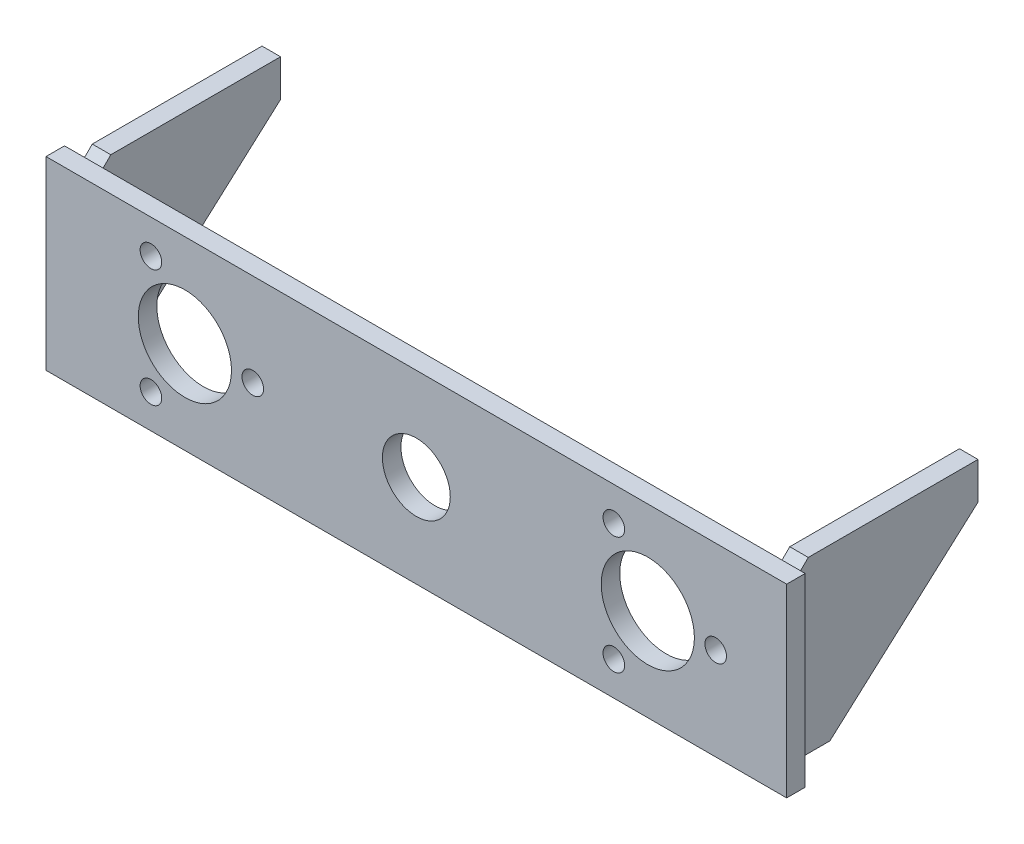
ISO-10303-21;
HEADER;
FILE_DESCRIPTION(('STEP AP214'),'2;1');
FILE_NAME('part.step','',(''),(''),'','','');
FILE_SCHEMA(('AUTOMOTIVE_DESIGN { 1 0 10303 214 1 1 1 1 }'));
ENDSEC;
DATA;
#1=APPLICATION_CONTEXT('core data for automotive mechanical design processes');
#2=APPLICATION_PROTOCOL_DEFINITION('international standard','automotive_design',2000,#1);
#3=PRODUCT_CONTEXT('',#1,'mechanical');
#4=PRODUCT('Part','Part','',(#3));
#5=PRODUCT_RELATED_PRODUCT_CATEGORY('part','',(#4));
#6=PRODUCT_DEFINITION_FORMATION('','',#4);
#7=PRODUCT_DEFINITION_CONTEXT('part definition',#1,'design');
#8=PRODUCT_DEFINITION('design','',#6,#7);
#9=PRODUCT_DEFINITION_SHAPE('','',#8);
#10=(LENGTH_UNIT() NAMED_UNIT(*) SI_UNIT(.MILLI.,.METRE.));
#11=(NAMED_UNIT(*) PLANE_ANGLE_UNIT() SI_UNIT($,.RADIAN.));
#12=(NAMED_UNIT(*) SI_UNIT($,.STERADIAN.) SOLID_ANGLE_UNIT());
#13=UNCERTAINTY_MEASURE_WITH_UNIT(LENGTH_MEASURE(1.E-05),#10,'distance_accuracy_value','');
#14=(GEOMETRIC_REPRESENTATION_CONTEXT(3) GLOBAL_UNCERTAINTY_ASSIGNED_CONTEXT((#13)) GLOBAL_UNIT_ASSIGNED_CONTEXT((#10,
#11,#12)) REPRESENTATION_CONTEXT('',''));
#15=CARTESIAN_POINT('',(0.,0.,0.));
#16=DIRECTION('',(0.,0.,1.));
#17=DIRECTION('',(1.,0.,0.));
#18=AXIS2_PLACEMENT_3D('',#15,#16,#17);
#19=CARTESIAN_POINT('',(-116.,30.,-11.));
#20=DIRECTION('',(0.,0.707106781186548,0.707106781186547));
#21=DIRECTION('',(0.,-0.707106781186547,0.707106781186548));
#22=AXIS2_PLACEMENT_3D('',#19,#20,#21);
#23=PLANE('',#22);
#24=DIRECTION('',(0.,-0.707106781186547,0.707106781186548));
#25=VECTOR('',#24,1.);
#26=CARTESIAN_POINT('',(-110.,30.,-11.));
#27=LINE('',#26,#25);
#28=CARTESIAN_POINT('',(-110.,30.,-11.));
#29=VERTEX_POINT('',#28);
#30=CARTESIAN_POINT('',(-110.,25.,-6.));
#31=VERTEX_POINT('',#30);
#32=EDGE_CURVE('E133',#29,#31,#27,.T.);
#33=ORIENTED_EDGE('',*,*,#32,.F.);
#34=DIRECTION('',(1.,0.,0.));
#35=VECTOR('',#34,1.);
#36=CARTESIAN_POINT('',(-116.,30.,-11.));
#37=LINE('',#36,#35);
#38=CARTESIAN_POINT('',(-116.,30.,-11.));
#39=VERTEX_POINT('',#38);
#40=EDGE_CURVE('E12',#39,#29,#37,.T.);
#41=ORIENTED_EDGE('',*,*,#40,.F.);
#42=DIRECTION('',(0.,-0.707106781186547,0.707106781186548));
#43=VECTOR('',#42,1.);
#44=CARTESIAN_POINT('',(-116.,30.,-11.));
#45=LINE('',#44,#43);
#46=CARTESIAN_POINT('',(-116.,25.,-6.));
#47=VERTEX_POINT('',#46);
#48=EDGE_CURVE('E147',#39,#47,#45,.T.);
#49=ORIENTED_EDGE('',*,*,#48,.T.);
#50=DIRECTION('',(1.,0.,0.));
#51=VECTOR('',#50,1.);
#52=CARTESIAN_POINT('',(-116.,25.,-6.));
#53=LINE('',#52,#51);
#54=EDGE_CURVE('E51',#47,#31,#53,.T.);
#55=ORIENTED_EDGE('',*,*,#54,.T.);
#56=EDGE_LOOP('',(#33,#41,#49,#55));
#57=FACE_BOUND('',#56,.T.);
#58=ADVANCED_FACE('F48',(#57),#23,.T.);
#59=CARTESIAN_POINT('',(-116.,30.,-66.));
#60=DIRECTION('',(0.,1.,0.));
#61=DIRECTION('',(0.,0.,1.));
#62=AXIS2_PLACEMENT_3D('',#59,#60,#61);
#63=PLANE('',#62);
#64=DIRECTION('',(0.,0.,1.));
#65=VECTOR('',#64,1.);
#66=CARTESIAN_POINT('',(-110.,30.,-66.));
#67=LINE('',#66,#65);
#68=CARTESIAN_POINT('',(-110.,30.,-66.));
#69=VERTEX_POINT('',#68);
#70=EDGE_CURVE('E145',#69,#29,#67,.T.);
#71=ORIENTED_EDGE('',*,*,#70,.F.);
#72=DIRECTION('',(1.,0.,0.));
#73=VECTOR('',#72,1.);
#74=CARTESIAN_POINT('',(-116.,30.,-66.));
#75=LINE('',#74,#73);
#76=CARTESIAN_POINT('',(-116.,30.,-66.));
#77=VERTEX_POINT('',#76);
#78=EDGE_CURVE('E57',#77,#69,#75,.T.);
#79=ORIENTED_EDGE('',*,*,#78,.F.);
#80=DIRECTION('',(0.,0.,1.));
#81=VECTOR('',#80,1.);
#82=CARTESIAN_POINT('',(-116.,30.,-66.));
#83=LINE('',#82,#81);
#84=EDGE_CURVE('E123',#77,#39,#83,.T.);
#85=ORIENTED_EDGE('',*,*,#84,.T.);
#86=ORIENTED_EDGE('',*,*,#40,.T.);
#87=EDGE_LOOP('',(#71,#79,#85,#86));
#88=FACE_BOUND('',#87,.T.);
#89=ADVANCED_FACE('F155',(#88),#63,.T.);
#90=CARTESIAN_POINT('',(-116.,18.,-66.));
#91=DIRECTION('',(0.,0.,-1.));
#92=DIRECTION('',(0.,1.,0.));
#93=AXIS2_PLACEMENT_3D('',#90,#91,#92);
#94=PLANE('',#93);
#95=DIRECTION('',(0.,1.,0.));
#96=VECTOR('',#95,1.);
#97=CARTESIAN_POINT('',(-110.,18.,-66.));
#98=LINE('',#97,#96);
#99=CARTESIAN_POINT('',(-110.,18.,-66.));
#100=VERTEX_POINT('',#99);
#101=EDGE_CURVE('E110',#100,#69,#98,.T.);
#102=ORIENTED_EDGE('',*,*,#101,.F.);
#103=DIRECTION('',(1.,0.,0.));
#104=VECTOR('',#103,1.);
#105=CARTESIAN_POINT('',(-116.,18.,-66.));
#106=LINE('',#105,#104);
#107=CARTESIAN_POINT('',(-116.,18.,-66.));
#108=VERTEX_POINT('',#107);
#109=EDGE_CURVE('E105',#108,#100,#106,.T.);
#110=ORIENTED_EDGE('',*,*,#109,.F.);
#111=DIRECTION('',(0.,1.,0.));
#112=VECTOR('',#111,1.);
#113=CARTESIAN_POINT('',(-116.,18.,-66.));
#114=LINE('',#113,#112);
#115=EDGE_CURVE('E108',#108,#77,#114,.T.);
#116=ORIENTED_EDGE('',*,*,#115,.T.);
#117=ORIENTED_EDGE('',*,*,#78,.T.);
#118=EDGE_LOOP('',(#102,#110,#116,#117));
#119=FACE_BOUND('',#118,.T.);
#120=ADVANCED_FACE('F107',(#119),#94,.T.);
#121=CARTESIAN_POINT('',(-116.,-25.,-18.));
#122=DIRECTION('',(0.,-0.744835335723058,-0.66724832158524));
#123=DIRECTION('',(0.,0.66724832158524,-0.744835335723058));
#124=AXIS2_PLACEMENT_3D('',#121,#122,#123);
#125=PLANE('',#124);
#126=DIRECTION('',(0.,0.66724832158524,-0.744835335723058));
#127=VECTOR('',#126,1.);
#128=CARTESIAN_POINT('',(-110.,-25.,-18.));
#129=LINE('',#128,#127);
#130=CARTESIAN_POINT('',(-110.,-25.,-18.));
#131=VERTEX_POINT('',#130);
#132=EDGE_CURVE('E142',#131,#100,#129,.T.);
#133=ORIENTED_EDGE('',*,*,#132,.F.);
#134=DIRECTION('',(1.,0.,0.));
#135=VECTOR('',#134,1.);
#136=CARTESIAN_POINT('',(-116.,-25.,-18.));
#137=LINE('',#136,#135);
#138=CARTESIAN_POINT('',(-116.,-25.,-18.));
#139=VERTEX_POINT('',#138);
#140=EDGE_CURVE('E115',#139,#131,#137,.T.);
#141=ORIENTED_EDGE('',*,*,#140,.F.);
#142=DIRECTION('',(0.,0.66724832158524,-0.744835335723058));
#143=VECTOR('',#142,1.);
#144=CARTESIAN_POINT('',(-116.,-25.,-18.));
#145=LINE('',#144,#143);
#146=EDGE_CURVE('E121',#139,#108,#145,.T.);
#147=ORIENTED_EDGE('',*,*,#146,.T.);
#148=ORIENTED_EDGE('',*,*,#109,.T.);
#149=EDGE_LOOP('',(#133,#141,#147,#148));
#150=FACE_BOUND('',#149,.T.);
#151=ADVANCED_FACE('F125',(#150),#125,.T.);
#152=CARTESIAN_POINT('',(-116.,-25.,-6.));
#153=DIRECTION('',(0.,-1.,0.));
#154=DIRECTION('',(0.,0.,-1.));
#155=AXIS2_PLACEMENT_3D('',#152,#153,#154);
#156=PLANE('',#155);
#157=DIRECTION('',(0.,0.,-1.));
#158=VECTOR('',#157,1.);
#159=CARTESIAN_POINT('',(-110.,-25.,-6.));
#160=LINE('',#159,#158);
#161=CARTESIAN_POINT('',(-110.,-25.,-6.));
#162=VERTEX_POINT('',#161);
#163=EDGE_CURVE('E139',#162,#131,#160,.T.);
#164=ORIENTED_EDGE('',*,*,#163,.F.);
#165=DIRECTION('',(1.,0.,0.));
#166=VECTOR('',#165,1.);
#167=CARTESIAN_POINT('',(-116.,-25.,-6.));
#168=LINE('',#167,#166);
#169=CARTESIAN_POINT('',(-116.,-25.,-6.));
#170=VERTEX_POINT('',#169);
#171=EDGE_CURVE('E150',#170,#162,#168,.T.);
#172=ORIENTED_EDGE('',*,*,#171,.F.);
#173=DIRECTION('',(0.,0.,-1.));
#174=VECTOR('',#173,1.);
#175=CARTESIAN_POINT('',(-116.,-25.,-6.));
#176=LINE('',#175,#174);
#177=EDGE_CURVE('E126',#170,#139,#176,.T.);
#178=ORIENTED_EDGE('',*,*,#177,.T.);
#179=ORIENTED_EDGE('',*,*,#140,.T.);
#180=EDGE_LOOP('',(#164,#172,#178,#179));
#181=FACE_BOUND('',#180,.T.);
#182=ADVANCED_FACE('F168',(#181),#156,.T.);
#183=CARTESIAN_POINT('',(-116.,25.,-6.));
#184=DIRECTION('',(0.,0.,1.));
#185=DIRECTION('',(1.,0.,0.));
#186=AXIS2_PLACEMENT_3D('',#183,#184,#185);
#187=PLANE('',#186);
#188=DIRECTION('',(0.,-1.,0.));
#189=VECTOR('',#188,1.);
#190=CARTESIAN_POINT('',(-110.,25.,-6.));
#191=LINE('',#190,#189);
#192=EDGE_CURVE('E136',#31,#162,#191,.T.);
#193=ORIENTED_EDGE('',*,*,#192,.F.);
#194=ORIENTED_EDGE('',*,*,#54,.F.);
#195=DIRECTION('',(0.,-1.,0.));
#196=VECTOR('',#195,1.);
#197=CARTESIAN_POINT('',(-116.,25.,-6.));
#198=LINE('',#197,#196);
#199=EDGE_CURVE('E128',#47,#170,#198,.T.);
#200=ORIENTED_EDGE('',*,*,#199,.T.);
#201=ORIENTED_EDGE('',*,*,#171,.T.);
#202=EDGE_LOOP('',(#193,#194,#200,#201));
#203=FACE_BOUND('',#202,.T.);
#204=ADVANCED_FACE('F152',(#203),#187,.T.);
#205=CARTESIAN_POINT('',(-116.,0.,0.));
#206=DIRECTION('',(1.,0.,0.));
#207=DIRECTION('',(0.,0.,-1.));
#208=AXIS2_PLACEMENT_3D('',#205,#206,#207);
#209=PLANE('',#208);
#210=ORIENTED_EDGE('',*,*,#48,.F.);
#211=ORIENTED_EDGE('',*,*,#84,.F.);
#212=ORIENTED_EDGE('',*,*,#115,.F.);
#213=ORIENTED_EDGE('',*,*,#146,.F.);
#214=ORIENTED_EDGE('',*,*,#177,.F.);
#215=ORIENTED_EDGE('',*,*,#199,.F.);
#216=EDGE_LOOP('',(#210,#211,#212,#213,#214,#215));
#217=FACE_BOUND('',#216,.T.);
#218=ADVANCED_FACE('F119',(#217),#209,.F.);
#219=CARTESIAN_POINT('',(-110.,0.,0.));
#220=DIRECTION('',(1.,0.,0.));
#221=DIRECTION('',(0.,0.,-1.));
#222=AXIS2_PLACEMENT_3D('',#219,#220,#221);
#223=PLANE('',#222);
#224=ORIENTED_EDGE('',*,*,#32,.T.);
#225=ORIENTED_EDGE('',*,*,#192,.T.);
#226=ORIENTED_EDGE('',*,*,#163,.T.);
#227=ORIENTED_EDGE('',*,*,#132,.T.);
#228=ORIENTED_EDGE('',*,*,#101,.T.);
#229=ORIENTED_EDGE('',*,*,#70,.T.);
#230=EDGE_LOOP('',(#224,#225,#226,#227,#228,#229));
#231=FACE_BOUND('',#230,.T.);
#232=ADVANCED_FACE('F154',(#231),#223,.T.);
#233=CLOSED_SHELL('',(#58,#89,#120,#151,#182,#204,#218,#232));
#234=MANIFOLD_SOLID_BREP('B2',#233);
#235=CARTESIAN_POINT('',(116.,25.,-6.));
#236=DIRECTION('',(0.,-0.707106781186548,-0.707106781186547));
#237=DIRECTION('',(0.,0.707106781186547,-0.707106781186548));
#238=AXIS2_PLACEMENT_3D('',#235,#236,#237);
#239=PLANE('',#238);
#240=DIRECTION('',(0.,-0.707106781186547,0.707106781186548));
#241=VECTOR('',#240,1.);
#242=CARTESIAN_POINT('',(110.,25.,-6.));
#243=LINE('',#242,#241);
#244=CARTESIAN_POINT('',(110.,30.,-11.));
#245=VERTEX_POINT('',#244);
#246=CARTESIAN_POINT('',(110.,25.,-6.));
#247=VERTEX_POINT('',#246);
#248=EDGE_CURVE('E333',#245,#247,#243,.T.);
#249=ORIENTED_EDGE('',*,*,#248,.T.);
#250=DIRECTION('',(-1.,0.,0.));
#251=VECTOR('',#250,1.);
#252=CARTESIAN_POINT('',(116.,25.,-6.));
#253=LINE('',#252,#251);
#254=CARTESIAN_POINT('',(116.,25.,-6.));
#255=VERTEX_POINT('',#254);
#256=EDGE_CURVE('E46',#255,#247,#253,.T.);
#257=ORIENTED_EDGE('',*,*,#256,.F.);
#258=DIRECTION('',(0.,-0.707106781186547,0.707106781186548));
#259=VECTOR('',#258,1.);
#260=CARTESIAN_POINT('',(116.,25.,-6.));
#261=LINE('',#260,#259);
#262=CARTESIAN_POINT('',(116.,30.,-11.));
#263=VERTEX_POINT('',#262);
#264=EDGE_CURVE('E343',#263,#255,#261,.T.);
#265=ORIENTED_EDGE('',*,*,#264,.F.);
#266=DIRECTION('',(-1.,0.,0.));
#267=VECTOR('',#266,1.);
#268=CARTESIAN_POINT('',(116.,30.,-11.));
#269=LINE('',#268,#267);
#270=EDGE_CURVE('E329',#263,#245,#269,.T.);
#271=ORIENTED_EDGE('',*,*,#270,.T.);
#272=EDGE_LOOP('',(#249,#257,#265,#271));
#273=FACE_BOUND('',#272,.T.);
#274=ADVANCED_FACE('F249',(#273),#239,.F.);
#275=CARTESIAN_POINT('',(116.,-25.,-6.));
#276=DIRECTION('',(0.,0.,-1.));
#277=DIRECTION('',(-1.,0.,0.));
#278=AXIS2_PLACEMENT_3D('',#275,#276,#277);
#279=PLANE('',#278);
#280=DIRECTION('',(0.,-1.,0.));
#281=VECTOR('',#280,1.);
#282=CARTESIAN_POINT('',(110.,-25.,-6.));
#283=LINE('',#282,#281);
#284=CARTESIAN_POINT('',(110.,-25.,-6.));
#285=VERTEX_POINT('',#284);
#286=EDGE_CURVE('E336',#247,#285,#283,.T.);
#287=ORIENTED_EDGE('',*,*,#286,.T.);
#288=DIRECTION('',(-1.,0.,0.));
#289=VECTOR('',#288,1.);
#290=CARTESIAN_POINT('',(116.,-25.,-6.));
#291=LINE('',#290,#289);
#292=CARTESIAN_POINT('',(116.,-25.,-6.));
#293=VERTEX_POINT('',#292);
#294=EDGE_CURVE('E257',#293,#285,#291,.T.);
#295=ORIENTED_EDGE('',*,*,#294,.F.);
#296=DIRECTION('',(0.,-1.,0.));
#297=VECTOR('',#296,1.);
#298=CARTESIAN_POINT('',(116.,-25.,-6.));
#299=LINE('',#298,#297);
#300=EDGE_CURVE('E302',#255,#293,#299,.T.);
#301=ORIENTED_EDGE('',*,*,#300,.F.);
#302=ORIENTED_EDGE('',*,*,#256,.T.);
#303=EDGE_LOOP('',(#287,#295,#301,#302));
#304=FACE_BOUND('',#303,.T.);
#305=ADVANCED_FACE('F367',(#304),#279,.F.);
#306=CARTESIAN_POINT('',(116.,-25.,-18.));
#307=DIRECTION('',(0.,1.,0.));
#308=DIRECTION('',(0.,0.,1.));
#309=AXIS2_PLACEMENT_3D('',#306,#307,#308);
#310=PLANE('',#309);
#311=DIRECTION('',(0.,0.,-1.));
#312=VECTOR('',#311,1.);
#313=CARTESIAN_POINT('',(110.,-25.,-18.));
#314=LINE('',#313,#312);
#315=CARTESIAN_POINT('',(110.,-25.,-18.));
#316=VERTEX_POINT('',#315);
#317=EDGE_CURVE('E338',#285,#316,#314,.T.);
#318=ORIENTED_EDGE('',*,*,#317,.T.);
#319=DIRECTION('',(-1.,0.,0.));
#320=VECTOR('',#319,1.);
#321=CARTESIAN_POINT('',(116.,-25.,-18.));
#322=LINE('',#321,#320);
#323=CARTESIAN_POINT('',(116.,-25.,-18.));
#324=VERTEX_POINT('',#323);
#325=EDGE_CURVE('E324',#324,#316,#322,.T.);
#326=ORIENTED_EDGE('',*,*,#325,.F.);
#327=DIRECTION('',(0.,0.,-1.));
#328=VECTOR('',#327,1.);
#329=CARTESIAN_POINT('',(116.,-25.,-18.));
#330=LINE('',#329,#328);
#331=EDGE_CURVE('E315',#293,#324,#330,.T.);
#332=ORIENTED_EDGE('',*,*,#331,.F.);
#333=ORIENTED_EDGE('',*,*,#294,.T.);
#334=EDGE_LOOP('',(#318,#326,#332,#333));
#335=FACE_BOUND('',#334,.T.);
#336=ADVANCED_FACE('F349',(#335),#310,.F.);
#337=CARTESIAN_POINT('',(116.,18.,-66.));
#338=DIRECTION('',(0.,0.744835335723058,0.66724832158524));
#339=DIRECTION('',(0.,-0.66724832158524,0.744835335723058));
#340=AXIS2_PLACEMENT_3D('',#337,#338,#339);
#341=PLANE('',#340);
#342=DIRECTION('',(0.,0.66724832158524,-0.744835335723058));
#343=VECTOR('',#342,1.);
#344=CARTESIAN_POINT('',(110.,18.,-66.));
#345=LINE('',#344,#343);
#346=CARTESIAN_POINT('',(110.,18.,-66.));
#347=VERTEX_POINT('',#346);
#348=EDGE_CURVE('E323',#316,#347,#345,.T.);
#349=ORIENTED_EDGE('',*,*,#348,.T.);
#350=DIRECTION('',(-1.,0.,0.));
#351=VECTOR('',#350,1.);
#352=CARTESIAN_POINT('',(116.,18.,-66.));
#353=LINE('',#352,#351);
#354=CARTESIAN_POINT('',(116.,18.,-66.));
#355=VERTEX_POINT('',#354);
#356=EDGE_CURVE('E320',#355,#347,#353,.T.);
#357=ORIENTED_EDGE('',*,*,#356,.F.);
#358=DIRECTION('',(0.,0.66724832158524,-0.744835335723058));
#359=VECTOR('',#358,1.);
#360=CARTESIAN_POINT('',(116.,18.,-66.));
#361=LINE('',#360,#359);
#362=EDGE_CURVE('E309',#324,#355,#361,.T.);
#363=ORIENTED_EDGE('',*,*,#362,.F.);
#364=ORIENTED_EDGE('',*,*,#325,.T.);
#365=EDGE_LOOP('',(#349,#357,#363,#364));
#366=FACE_BOUND('',#365,.T.);
#367=ADVANCED_FACE('F321',(#366),#341,.F.);
#368=CARTESIAN_POINT('',(116.,30.,-66.));
#369=DIRECTION('',(0.,0.,1.));
#370=DIRECTION('',(0.,-1.,0.));
#371=AXIS2_PLACEMENT_3D('',#368,#369,#370);
#372=PLANE('',#371);
#373=DIRECTION('',(0.,1.,0.));
#374=VECTOR('',#373,1.);
#375=CARTESIAN_POINT('',(110.,30.,-66.));
#376=LINE('',#375,#374);
#377=CARTESIAN_POINT('',(110.,30.,-66.));
#378=VERTEX_POINT('',#377);
#379=EDGE_CURVE('E288',#347,#378,#376,.T.);
#380=ORIENTED_EDGE('',*,*,#379,.T.);
#381=DIRECTION('',(-1.,0.,0.));
#382=VECTOR('',#381,1.);
#383=CARTESIAN_POINT('',(116.,30.,-66.));
#384=LINE('',#383,#382);
#385=CARTESIAN_POINT('',(116.,30.,-66.));
#386=VERTEX_POINT('',#385);
#387=EDGE_CURVE('E325',#386,#378,#384,.T.);
#388=ORIENTED_EDGE('',*,*,#387,.F.);
#389=DIRECTION('',(0.,1.,0.));
#390=VECTOR('',#389,1.);
#391=CARTESIAN_POINT('',(116.,30.,-66.));
#392=LINE('',#391,#390);
#393=EDGE_CURVE('E313',#355,#386,#392,.T.);
#394=ORIENTED_EDGE('',*,*,#393,.F.);
#395=ORIENTED_EDGE('',*,*,#356,.T.);
#396=EDGE_LOOP('',(#380,#388,#394,#395));
#397=FACE_BOUND('',#396,.T.);
#398=ADVANCED_FACE('F327',(#397),#372,.F.);
#399=CARTESIAN_POINT('',(116.,30.,-11.));
#400=DIRECTION('',(0.,-1.,0.));
#401=DIRECTION('',(0.,0.,-1.));
#402=AXIS2_PLACEMENT_3D('',#399,#400,#401);
#403=PLANE('',#402);
#404=DIRECTION('',(0.,0.,1.));
#405=VECTOR('',#404,1.);
#406=CARTESIAN_POINT('',(110.,30.,-11.));
#407=LINE('',#406,#405);
#408=EDGE_CURVE('E294',#378,#245,#407,.T.);
#409=ORIENTED_EDGE('',*,*,#408,.T.);
#410=ORIENTED_EDGE('',*,*,#270,.F.);
#411=DIRECTION('',(0.,0.,1.));
#412=VECTOR('',#411,1.);
#413=CARTESIAN_POINT('',(116.,30.,-11.));
#414=LINE('',#413,#412);
#415=EDGE_CURVE('E265',#386,#263,#414,.T.);
#416=ORIENTED_EDGE('',*,*,#415,.F.);
#417=ORIENTED_EDGE('',*,*,#387,.T.);
#418=EDGE_LOOP('',(#409,#410,#416,#417));
#419=FACE_BOUND('',#418,.T.);
#420=ADVANCED_FACE('F356',(#419),#403,.F.);
#421=CARTESIAN_POINT('',(116.,0.,0.));
#422=DIRECTION('',(-1.,0.,0.));
#423=DIRECTION('',(0.,0.,1.));
#424=AXIS2_PLACEMENT_3D('',#421,#422,#423);
#425=PLANE('',#424);
#426=ORIENTED_EDGE('',*,*,#264,.T.);
#427=ORIENTED_EDGE('',*,*,#300,.T.);
#428=ORIENTED_EDGE('',*,*,#331,.T.);
#429=ORIENTED_EDGE('',*,*,#362,.T.);
#430=ORIENTED_EDGE('',*,*,#393,.T.);
#431=ORIENTED_EDGE('',*,*,#415,.T.);
#432=EDGE_LOOP('',(#426,#427,#428,#429,#430,#431));
#433=FACE_BOUND('',#432,.T.);
#434=ADVANCED_FACE('F311',(#433),#425,.F.);
#435=CARTESIAN_POINT('',(110.,0.,0.));
#436=DIRECTION('',(-1.,0.,0.));
#437=DIRECTION('',(0.,0.,1.));
#438=AXIS2_PLACEMENT_3D('',#435,#436,#437);
#439=PLANE('',#438);
#440=ORIENTED_EDGE('',*,*,#248,.F.);
#441=ORIENTED_EDGE('',*,*,#408,.F.);
#442=ORIENTED_EDGE('',*,*,#379,.F.);
#443=ORIENTED_EDGE('',*,*,#348,.F.);
#444=ORIENTED_EDGE('',*,*,#317,.F.);
#445=ORIENTED_EDGE('',*,*,#286,.F.);
#446=EDGE_LOOP('',(#440,#441,#442,#443,#444,#445));
#447=FACE_BOUND('',#446,.T.);
#448=ADVANCED_FACE('F352',(#447),#439,.T.);
#449=CLOSED_SHELL('',(#274,#305,#336,#367,#398,#420,#434,#448));
#450=MANIFOLD_SOLID_BREP('B6',#449);
#451=CARTESIAN_POINT('',(120.,30.,-6.));
#452=DIRECTION('',(1.,0.,0.));
#453=DIRECTION('',(0.,0.,-1.));
#454=AXIS2_PLACEMENT_3D('',#451,#452,#453);
#455=PLANE('',#454);
#456=DIRECTION('',(0.,1.,0.));
#457=VECTOR('',#456,1.);
#458=CARTESIAN_POINT('',(120.,30.,0.));
#459=LINE('',#458,#457);
#460=CARTESIAN_POINT('',(120.,-30.,0.));
#461=VERTEX_POINT('',#460);
#462=CARTESIAN_POINT('',(120.,30.,0.));
#463=VERTEX_POINT('',#462);
#464=EDGE_CURVE('E506',#461,#463,#459,.T.);
#465=ORIENTED_EDGE('',*,*,#464,.F.);
#466=DIRECTION('',(0.,0.,1.));
#467=VECTOR('',#466,1.);
#468=CARTESIAN_POINT('',(120.,-30.,-6.));
#469=LINE('',#468,#467);
#470=CARTESIAN_POINT('',(120.,-30.,-6.));
#471=VERTEX_POINT('',#470);
#472=EDGE_CURVE('E247',#471,#461,#469,.T.);
#473=ORIENTED_EDGE('',*,*,#472,.F.);
#474=DIRECTION('',(0.,1.,0.));
#475=VECTOR('',#474,1.);
#476=CARTESIAN_POINT('',(120.,30.,-6.));
#477=LINE('',#476,#475);
#478=CARTESIAN_POINT('',(120.,30.,-6.));
#479=VERTEX_POINT('',#478);
#480=EDGE_CURVE('E499',#471,#479,#477,.T.);
#481=ORIENTED_EDGE('',*,*,#480,.T.);
#482=DIRECTION('',(0.,0.,1.));
#483=VECTOR('',#482,1.);
#484=CARTESIAN_POINT('',(120.,30.,-6.));
#485=LINE('',#484,#483);
#486=EDGE_CURVE('E444',#479,#463,#485,.T.);
#487=ORIENTED_EDGE('',*,*,#486,.T.);
#488=EDGE_LOOP('',(#465,#473,#481,#487));
#489=FACE_BOUND('',#488,.T.);
#490=ADVANCED_FACE('F441',(#489),#455,.T.);
#491=CARTESIAN_POINT('',(-120.,-30.,-6.));
#492=DIRECTION('',(0.,-1.,0.));
#493=DIRECTION('',(0.,0.,-1.));
#494=AXIS2_PLACEMENT_3D('',#491,#492,#493);
#495=PLANE('',#494);
#496=DIRECTION('',(1.,0.,0.));
#497=VECTOR('',#496,1.);
#498=CARTESIAN_POINT('',(-120.,-30.,0.));
#499=LINE('',#498,#497);
#500=CARTESIAN_POINT('',(-120.,-30.,0.));
#501=VERTEX_POINT('',#500);
#502=EDGE_CURVE('E501',#501,#461,#499,.T.);
#503=ORIENTED_EDGE('',*,*,#502,.F.);
#504=DIRECTION('',(0.,0.,1.));
#505=VECTOR('',#504,1.);
#506=CARTESIAN_POINT('',(-120.,-30.,-6.));
#507=LINE('',#506,#505);
#508=CARTESIAN_POINT('',(-120.,-30.,-6.));
#509=VERTEX_POINT('',#508);
#510=EDGE_CURVE('E450',#509,#501,#507,.T.);
#511=ORIENTED_EDGE('',*,*,#510,.F.);
#512=DIRECTION('',(1.,0.,0.));
#513=VECTOR('',#512,1.);
#514=CARTESIAN_POINT('',(-120.,-30.,-6.));
#515=LINE('',#514,#513);
#516=EDGE_CURVE('E496',#509,#471,#515,.T.);
#517=ORIENTED_EDGE('',*,*,#516,.T.);
#518=ORIENTED_EDGE('',*,*,#472,.T.);
#519=EDGE_LOOP('',(#503,#511,#517,#518));
#520=FACE_BOUND('',#519,.T.);
#521=ADVANCED_FACE('F517',(#520),#495,.T.);
#522=CARTESIAN_POINT('',(-120.,30.,-6.));
#523=DIRECTION('',(-1.,0.,0.));
#524=DIRECTION('',(0.,-1.,0.));
#525=AXIS2_PLACEMENT_3D('',#522,#523,#524);
#526=PLANE('',#525);
#527=DIRECTION('',(0.,-1.,0.));
#528=VECTOR('',#527,1.);
#529=CARTESIAN_POINT('',(-120.,30.,0.));
#530=LINE('',#529,#528);
#531=CARTESIAN_POINT('',(-120.,30.,0.));
#532=VERTEX_POINT('',#531);
#533=EDGE_CURVE('E491',#532,#501,#530,.T.);
#534=ORIENTED_EDGE('',*,*,#533,.F.);
#535=DIRECTION('',(0.,0.,1.));
#536=VECTOR('',#535,1.);
#537=CARTESIAN_POINT('',(-120.,30.,-6.));
#538=LINE('',#537,#536);
#539=CARTESIAN_POINT('',(-120.,30.,-6.));
#540=VERTEX_POINT('',#539);
#541=EDGE_CURVE('E486',#540,#532,#538,.T.);
#542=ORIENTED_EDGE('',*,*,#541,.F.);
#543=DIRECTION('',(0.,-1.,0.));
#544=VECTOR('',#543,1.);
#545=CARTESIAN_POINT('',(-120.,30.,-6.));
#546=LINE('',#545,#544);
#547=EDGE_CURVE('E489',#540,#509,#546,.T.);
#548=ORIENTED_EDGE('',*,*,#547,.T.);
#549=ORIENTED_EDGE('',*,*,#510,.T.);
#550=EDGE_LOOP('',(#534,#542,#548,#549));
#551=FACE_BOUND('',#550,.T.);
#552=ADVANCED_FACE('F488',(#551),#526,.T.);
#553=CARTESIAN_POINT('',(-120.,30.,-6.));
#554=DIRECTION('',(0.,1.,0.));
#555=DIRECTION('',(0.,0.,1.));
#556=AXIS2_PLACEMENT_3D('',#553,#554,#555);
#557=PLANE('',#556);
#558=DIRECTION('',(-1.,0.,0.));
#559=VECTOR('',#558,1.);
#560=CARTESIAN_POINT('',(-120.,30.,0.));
#561=LINE('',#560,#559);
#562=EDGE_CURVE('E509',#463,#532,#561,.T.);
#563=ORIENTED_EDGE('',*,*,#562,.F.);
#564=ORIENTED_EDGE('',*,*,#486,.F.);
#565=DIRECTION('',(-1.,0.,0.));
#566=VECTOR('',#565,1.);
#567=CARTESIAN_POINT('',(-120.,30.,-6.));
#568=LINE('',#567,#566);
#569=EDGE_CURVE('E495',#479,#540,#568,.T.);
#570=ORIENTED_EDGE('',*,*,#569,.T.);
#571=ORIENTED_EDGE('',*,*,#541,.T.);
#572=EDGE_LOOP('',(#563,#564,#570,#571));
#573=FACE_BOUND('',#572,.T.);
#574=ADVANCED_FACE('F498',(#573),#557,.T.);
#575=CARTESIAN_POINT('',(0.,0.,-6.));
#576=DIRECTION('',(0.,0.,1.));
#577=DIRECTION('',(1.,0.,0.));
#578=AXIS2_PLACEMENT_3D('',#575,#576,#577);
#579=PLANE('',#578);
#580=CARTESIAN_POINT('',(-86.0000000000001,19.0525588832576,-6.));
#581=DIRECTION('',(0.,0.,-1.));
#582=DIRECTION('',(0.500000000000004,-0.866025403784436,0.));
#583=AXIS2_PLACEMENT_3D('',#580,#581,#582);
#584=CIRCLE('',#583,3.50000000000001);
#585=CARTESIAN_POINT('',(-84.2500000000001,16.0214699700121,-6.));
#586=VERTEX_POINT('',#585);
#587=EDGE_CURVE('E581',#586,#586,#584,.T.);
#588=ORIENTED_EDGE('',*,*,#587,.F.);
#589=EDGE_LOOP('',(#588));
#590=FACE_BOUND('',#589,.T.);
#591=CARTESIAN_POINT('',(-85.9999999999998,-19.0525588832578,-6.));
#592=DIRECTION('',(0.,0.,-1.));
#593=DIRECTION('',(0.499999999999992,0.866025403784443,0.));
#594=AXIS2_PLACEMENT_3D('',#591,#592,#593);
#595=CIRCLE('',#594,3.50000000000001);
#596=CARTESIAN_POINT('',(-84.2499999999999,-16.0214699700122,-6.));
#597=VERTEX_POINT('',#596);
#598=EDGE_CURVE('E587',#597,#597,#595,.T.);
#599=ORIENTED_EDGE('',*,*,#598,.F.);
#600=EDGE_LOOP('',(#599));
#601=FACE_BOUND('',#600,.T.);
#602=CARTESIAN_POINT('',(-53.,0.,-6.));
#603=DIRECTION('',(0.,0.,-1.));
#604=DIRECTION('',(-1.,0.,0.));
#605=AXIS2_PLACEMENT_3D('',#602,#603,#604);
#606=CIRCLE('',#605,3.50000000000001);
#607=CARTESIAN_POINT('',(-56.5,0.,-6.));
#608=VERTEX_POINT('',#607);
#609=EDGE_CURVE('E582',#608,#608,#606,.T.);
#610=ORIENTED_EDGE('',*,*,#609,.F.);
#611=EDGE_LOOP('',(#610));
#612=FACE_BOUND('',#611,.T.);
#613=CARTESIAN_POINT('',(63.9999999999999,19.0525588832576,-6.));
#614=DIRECTION('',(0.,0.,-1.));
#615=DIRECTION('',(0.500000000000004,-0.866025403784436,0.));
#616=AXIS2_PLACEMENT_3D('',#613,#614,#615);
#617=CIRCLE('',#616,3.50000000000001);
#618=CARTESIAN_POINT('',(65.7499999999999,16.0214699700121,-6.));
#619=VERTEX_POINT('',#618);
#620=EDGE_CURVE('E601',#619,#619,#617,.T.);
#621=ORIENTED_EDGE('',*,*,#620,.F.);
#622=EDGE_LOOP('',(#621));
#623=FACE_BOUND('',#622,.T.);
#624=CARTESIAN_POINT('',(64.0000000000002,-19.0525588832577,-6.));
#625=DIRECTION('',(0.,0.,-1.));
#626=DIRECTION('',(0.499999999999992,0.866025403784443,0.));
#627=AXIS2_PLACEMENT_3D('',#624,#625,#626);
#628=CIRCLE('',#627,3.50000000000001);
#629=CARTESIAN_POINT('',(65.7500000000002,-16.0214699700122,-6.));
#630=VERTEX_POINT('',#629);
#631=EDGE_CURVE('E602',#630,#630,#628,.T.);
#632=ORIENTED_EDGE('',*,*,#631,.F.);
#633=EDGE_LOOP('',(#632));
#634=FACE_BOUND('',#633,.T.);
#635=CARTESIAN_POINT('',(97.,0.,-6.));
#636=DIRECTION('',(0.,0.,-1.));
#637=DIRECTION('',(-1.,0.,0.));
#638=AXIS2_PLACEMENT_3D('',#635,#636,#637);
#639=CIRCLE('',#638,3.50000000000001);
#640=CARTESIAN_POINT('',(93.5,0.,-6.));
#641=VERTEX_POINT('',#640);
#642=EDGE_CURVE('E605',#641,#641,#639,.T.);
#643=ORIENTED_EDGE('',*,*,#642,.F.);
#644=EDGE_LOOP('',(#643));
#645=FACE_BOUND('',#644,.T.);
#646=CARTESIAN_POINT('',(-75.,0.,-6.));
#647=DIRECTION('',(0.,0.,1.));
#648=DIRECTION('',(1.,0.,0.));
#649=AXIS2_PLACEMENT_3D('',#646,#647,#648);
#650=CIRCLE('',#649,15.1);
#651=CARTESIAN_POINT('',(-59.9,0.,-6.));
#652=VERTEX_POINT('',#651);
#653=EDGE_CURVE('E624',#652,#652,#650,.T.);
#654=ORIENTED_EDGE('',*,*,#653,.T.);
#655=EDGE_LOOP('',(#654));
#656=FACE_BOUND('',#655,.T.);
#657=CARTESIAN_POINT('',(75.,0.,-6.));
#658=DIRECTION('',(0.,0.,1.));
#659=DIRECTION('',(1.,0.,0.));
#660=AXIS2_PLACEMENT_3D('',#657,#658,#659);
#661=CIRCLE('',#660,15.1);
#662=CARTESIAN_POINT('',(90.1,0.,-6.));
#663=VERTEX_POINT('',#662);
#664=EDGE_CURVE('E619',#663,#663,#661,.T.);
#665=ORIENTED_EDGE('',*,*,#664,.T.);
#666=EDGE_LOOP('',(#665));
#667=FACE_BOUND('',#666,.T.);
#668=CARTESIAN_POINT('',(0.,0.,-6.));
#669=DIRECTION('',(0.,0.,1.));
#670=DIRECTION('',(1.,0.,0.));
#671=AXIS2_PLACEMENT_3D('',#668,#669,#670);
#672=CIRCLE('',#671,11.);
#673=CARTESIAN_POINT('',(11.,0.,-6.));
#674=VERTEX_POINT('',#673);
#675=EDGE_CURVE('E510',#674,#674,#672,.T.);
#676=ORIENTED_EDGE('',*,*,#675,.T.);
#677=EDGE_LOOP('',(#676));
#678=FACE_BOUND('',#677,.T.);
#679=ORIENTED_EDGE('',*,*,#480,.F.);
#680=ORIENTED_EDGE('',*,*,#516,.F.);
#681=ORIENTED_EDGE('',*,*,#547,.F.);
#682=ORIENTED_EDGE('',*,*,#569,.F.);
#683=EDGE_LOOP('',(#679,#680,#681,#682));
#684=FACE_BOUND('',#683,.T.);
#685=ADVANCED_FACE('F494',(#590,#601,#612,#623,#634,#645,#656,#667,#678,#684),#579,.F.);
#686=CARTESIAN_POINT('',(0.,0.,0.));
#687=DIRECTION('',(0.,0.,1.));
#688=DIRECTION('',(1.,0.,0.));
#689=AXIS2_PLACEMENT_3D('',#686,#687,#688);
#690=PLANE('',#689);
#691=CARTESIAN_POINT('',(-86.0000000000001,19.0525588832576,0.));
#692=DIRECTION('',(0.,0.,-1.));
#693=DIRECTION('',(0.500000000000004,-0.866025403784436,0.));
#694=AXIS2_PLACEMENT_3D('',#691,#692,#693);
#695=CIRCLE('',#694,3.50000000000001);
#696=CARTESIAN_POINT('',(-84.2500000000001,16.0214699700121,0.));
#697=VERTEX_POINT('',#696);
#698=EDGE_CURVE('E579',#697,#697,#695,.T.);
#699=ORIENTED_EDGE('',*,*,#698,.T.);
#700=EDGE_LOOP('',(#699));
#701=FACE_BOUND('',#700,.T.);
#702=CARTESIAN_POINT('',(-85.9999999999998,-19.0525588832578,0.));
#703=DIRECTION('',(0.,0.,-1.));
#704=DIRECTION('',(0.499999999999992,0.866025403784443,0.));
#705=AXIS2_PLACEMENT_3D('',#702,#703,#704);
#706=CIRCLE('',#705,3.50000000000001);
#707=CARTESIAN_POINT('',(-84.2499999999999,-16.0214699700122,0.));
#708=VERTEX_POINT('',#707);
#709=EDGE_CURVE('E590',#708,#708,#706,.T.);
#710=ORIENTED_EDGE('',*,*,#709,.T.);
#711=EDGE_LOOP('',(#710));
#712=FACE_BOUND('',#711,.T.);
#713=CARTESIAN_POINT('',(-53.,0.,0.));
#714=DIRECTION('',(0.,0.,-1.));
#715=DIRECTION('',(-1.,0.,0.));
#716=AXIS2_PLACEMENT_3D('',#713,#714,#715);
#717=CIRCLE('',#716,3.50000000000001);
#718=CARTESIAN_POINT('',(-56.5,0.,0.));
#719=VERTEX_POINT('',#718);
#720=EDGE_CURVE('E585',#719,#719,#717,.T.);
#721=ORIENTED_EDGE('',*,*,#720,.T.);
#722=EDGE_LOOP('',(#721));
#723=FACE_BOUND('',#722,.T.);
#724=CARTESIAN_POINT('',(63.9999999999999,19.0525588832576,0.));
#725=DIRECTION('',(0.,0.,-1.));
#726=DIRECTION('',(0.500000000000004,-0.866025403784436,0.));
#727=AXIS2_PLACEMENT_3D('',#724,#725,#726);
#728=CIRCLE('',#727,3.50000000000001);
#729=CARTESIAN_POINT('',(65.7499999999999,16.0214699700121,0.));
#730=VERTEX_POINT('',#729);
#731=EDGE_CURVE('E598',#730,#730,#728,.T.);
#732=ORIENTED_EDGE('',*,*,#731,.T.);
#733=EDGE_LOOP('',(#732));
#734=FACE_BOUND('',#733,.T.);
#735=CARTESIAN_POINT('',(64.0000000000002,-19.0525588832577,0.));
#736=DIRECTION('',(0.,0.,-1.));
#737=DIRECTION('',(0.499999999999992,0.866025403784443,0.));
#738=AXIS2_PLACEMENT_3D('',#735,#736,#737);
#739=CIRCLE('',#738,3.50000000000001);
#740=CARTESIAN_POINT('',(65.7500000000002,-16.0214699700122,0.));
#741=VERTEX_POINT('',#740);
#742=EDGE_CURVE('E596',#741,#741,#739,.T.);
#743=ORIENTED_EDGE('',*,*,#742,.T.);
#744=EDGE_LOOP('',(#743));
#745=FACE_BOUND('',#744,.T.);
#746=CARTESIAN_POINT('',(97.,0.,0.));
#747=DIRECTION('',(0.,0.,-1.));
#748=DIRECTION('',(-1.,0.,0.));
#749=AXIS2_PLACEMENT_3D('',#746,#747,#748);
#750=CIRCLE('',#749,3.50000000000001);
#751=CARTESIAN_POINT('',(93.5,0.,0.));
#752=VERTEX_POINT('',#751);
#753=EDGE_CURVE('E610',#752,#752,#750,.T.);
#754=ORIENTED_EDGE('',*,*,#753,.T.);
#755=EDGE_LOOP('',(#754));
#756=FACE_BOUND('',#755,.T.);
#757=CARTESIAN_POINT('',(-75.,0.,0.));
#758=DIRECTION('',(0.,0.,1.));
#759=DIRECTION('',(1.,0.,0.));
#760=AXIS2_PLACEMENT_3D('',#757,#758,#759);
#761=CIRCLE('',#760,15.1);
#762=CARTESIAN_POINT('',(-59.9,0.,0.));
#763=VERTEX_POINT('',#762);
#764=EDGE_CURVE('E616',#763,#763,#761,.T.);
#765=ORIENTED_EDGE('',*,*,#764,.F.);
#766=EDGE_LOOP('',(#765));
#767=FACE_BOUND('',#766,.T.);
#768=CARTESIAN_POINT('',(75.,0.,0.));
#769=DIRECTION('',(0.,0.,1.));
#770=DIRECTION('',(1.,0.,0.));
#771=AXIS2_PLACEMENT_3D('',#768,#769,#770);
#772=CIRCLE('',#771,15.1);
#773=CARTESIAN_POINT('',(90.1,0.,0.));
#774=VERTEX_POINT('',#773);
#775=EDGE_CURVE('E613',#774,#774,#772,.T.);
#776=ORIENTED_EDGE('',*,*,#775,.F.);
#777=EDGE_LOOP('',(#776));
#778=FACE_BOUND('',#777,.T.);
#779=CARTESIAN_POINT('',(0.,0.,0.));
#780=DIRECTION('',(0.,0.,1.));
#781=DIRECTION('',(1.,0.,0.));
#782=AXIS2_PLACEMENT_3D('',#779,#780,#781);
#783=CIRCLE('',#782,11.);
#784=CARTESIAN_POINT('',(11.,0.,0.));
#785=VERTEX_POINT('',#784);
#786=EDGE_CURVE('E627',#785,#785,#783,.T.);
#787=ORIENTED_EDGE('',*,*,#786,.F.);
#788=EDGE_LOOP('',(#787));
#789=FACE_BOUND('',#788,.T.);
#790=ORIENTED_EDGE('',*,*,#464,.T.);
#791=ORIENTED_EDGE('',*,*,#562,.T.);
#792=ORIENTED_EDGE('',*,*,#533,.T.);
#793=ORIENTED_EDGE('',*,*,#502,.T.);
#794=EDGE_LOOP('',(#790,#791,#792,#793));
#795=FACE_BOUND('',#794,.T.);
#796=ADVANCED_FACE('F516',(#701,#712,#723,#734,#745,#756,#767,#778,#789,#795),#690,.T.);
#797=CARTESIAN_POINT('',(0.,0.,-66.));
#798=DIRECTION('',(0.,0.,1.));
#799=DIRECTION('',(1.,0.,0.));
#800=AXIS2_PLACEMENT_3D('',#797,#798,#799);
#801=CYLINDRICAL_SURFACE('',#800,11.);
#802=ORIENTED_EDGE('',*,*,#786,.T.);
#803=EDGE_LOOP('',(#802));
#804=FACE_BOUND('',#803,.T.);
#805=ORIENTED_EDGE('',*,*,#675,.F.);
#806=EDGE_LOOP('',(#805));
#807=FACE_BOUND('',#806,.T.);
#808=ADVANCED_FACE('F535',(#804,#807),#801,.F.);
#809=CARTESIAN_POINT('',(75.,0.,-66.));
#810=DIRECTION('',(0.,0.,1.));
#811=DIRECTION('',(1.,0.,0.));
#812=AXIS2_PLACEMENT_3D('',#809,#810,#811);
#813=CYLINDRICAL_SURFACE('',#812,15.1);
#814=ORIENTED_EDGE('',*,*,#775,.T.);
#815=EDGE_LOOP('',(#814));
#816=FACE_BOUND('',#815,.T.);
#817=ORIENTED_EDGE('',*,*,#664,.F.);
#818=EDGE_LOOP('',(#817));
#819=FACE_BOUND('',#818,.T.);
#820=ADVANCED_FACE('F542',(#816,#819),#813,.F.);
#821=CARTESIAN_POINT('',(-75.,0.,-66.));
#822=DIRECTION('',(0.,0.,1.));
#823=DIRECTION('',(1.,0.,0.));
#824=AXIS2_PLACEMENT_3D('',#821,#822,#823);
#825=CYLINDRICAL_SURFACE('',#824,15.1);
#826=ORIENTED_EDGE('',*,*,#764,.T.);
#827=EDGE_LOOP('',(#826));
#828=FACE_BOUND('',#827,.T.);
#829=ORIENTED_EDGE('',*,*,#653,.F.);
#830=EDGE_LOOP('',(#829));
#831=FACE_BOUND('',#830,.T.);
#832=ADVANCED_FACE('F546',(#828,#831),#825,.F.);
#833=CARTESIAN_POINT('',(97.,0.,0.));
#834=DIRECTION('',(0.,0.,-1.));
#835=DIRECTION('',(-1.,0.,0.));
#836=AXIS2_PLACEMENT_3D('',#833,#834,#835);
#837=CYLINDRICAL_SURFACE('',#836,3.50000000000001);
#838=ORIENTED_EDGE('',*,*,#753,.F.);
#839=EDGE_LOOP('',(#838));
#840=FACE_BOUND('',#839,.T.);
#841=ORIENTED_EDGE('',*,*,#642,.T.);
#842=EDGE_LOOP('',(#841));
#843=FACE_BOUND('',#842,.T.);
#844=ADVANCED_FACE('F550',(#840,#843),#837,.F.);
#845=CARTESIAN_POINT('',(64.0000000000002,-19.0525588832577,0.));
#846=DIRECTION('',(0.,0.,-1.));
#847=DIRECTION('',(0.499999999999992,0.866025403784443,0.));
#848=AXIS2_PLACEMENT_3D('',#845,#846,#847);
#849=CYLINDRICAL_SURFACE('',#848,3.50000000000001);
#850=ORIENTED_EDGE('',*,*,#742,.F.);
#851=EDGE_LOOP('',(#850));
#852=FACE_BOUND('',#851,.T.);
#853=ORIENTED_EDGE('',*,*,#631,.T.);
#854=EDGE_LOOP('',(#853));
#855=FACE_BOUND('',#854,.T.);
#856=ADVANCED_FACE('F554',(#852,#855),#849,.F.);
#857=CARTESIAN_POINT('',(63.9999999999999,19.0525588832576,0.));
#858=DIRECTION('',(0.,0.,-1.));
#859=DIRECTION('',(0.500000000000004,-0.866025403784436,0.));
#860=AXIS2_PLACEMENT_3D('',#857,#858,#859);
#861=CYLINDRICAL_SURFACE('',#860,3.50000000000001);
#862=ORIENTED_EDGE('',*,*,#731,.F.);
#863=EDGE_LOOP('',(#862));
#864=FACE_BOUND('',#863,.T.);
#865=ORIENTED_EDGE('',*,*,#620,.T.);
#866=EDGE_LOOP('',(#865));
#867=FACE_BOUND('',#866,.T.);
#868=ADVANCED_FACE('F558',(#864,#867),#861,.F.);
#869=CARTESIAN_POINT('',(-53.,0.,0.));
#870=DIRECTION('',(0.,0.,-1.));
#871=DIRECTION('',(-1.,0.,0.));
#872=AXIS2_PLACEMENT_3D('',#869,#870,#871);
#873=CYLINDRICAL_SURFACE('',#872,3.50000000000001);
#874=ORIENTED_EDGE('',*,*,#720,.F.);
#875=EDGE_LOOP('',(#874));
#876=FACE_BOUND('',#875,.T.);
#877=ORIENTED_EDGE('',*,*,#609,.T.);
#878=EDGE_LOOP('',(#877));
#879=FACE_BOUND('',#878,.T.);
#880=ADVANCED_FACE('F562',(#876,#879),#873,.F.);
#881=CARTESIAN_POINT('',(-85.9999999999998,-19.0525588832578,0.));
#882=DIRECTION('',(0.,0.,-1.));
#883=DIRECTION('',(0.499999999999992,0.866025403784443,0.));
#884=AXIS2_PLACEMENT_3D('',#881,#882,#883);
#885=CYLINDRICAL_SURFACE('',#884,3.50000000000001);
#886=ORIENTED_EDGE('',*,*,#709,.F.);
#887=EDGE_LOOP('',(#886));
#888=FACE_BOUND('',#887,.T.);
#889=ORIENTED_EDGE('',*,*,#598,.T.);
#890=EDGE_LOOP('',(#889));
#891=FACE_BOUND('',#890,.T.);
#892=ADVANCED_FACE('F566',(#888,#891),#885,.F.);
#893=CARTESIAN_POINT('',(-86.0000000000001,19.0525588832576,0.));
#894=DIRECTION('',(0.,0.,-1.));
#895=DIRECTION('',(0.500000000000004,-0.866025403784436,0.));
#896=AXIS2_PLACEMENT_3D('',#893,#894,#895);
#897=CYLINDRICAL_SURFACE('',#896,3.50000000000001);
#898=ORIENTED_EDGE('',*,*,#698,.F.);
#899=EDGE_LOOP('',(#898));
#900=FACE_BOUND('',#899,.T.);
#901=ORIENTED_EDGE('',*,*,#587,.T.);
#902=EDGE_LOOP('',(#901));
#903=FACE_BOUND('',#902,.T.);
#904=ADVANCED_FACE('F570',(#900,#903),#897,.F.);
#905=CLOSED_SHELL('',(#490,#521,#552,#574,#685,#796,#808,#820,#832,#844,#856,#868,#880,#892,#904));
#906=MANIFOLD_SOLID_BREP('B40',#905);
#907=ADVANCED_BREP_SHAPE_REPRESENTATION('',(#18,#234,#450,#906),#14);
#908=SHAPE_DEFINITION_REPRESENTATION(#9,#907);
ENDSEC;
END-ISO-10303-21;
